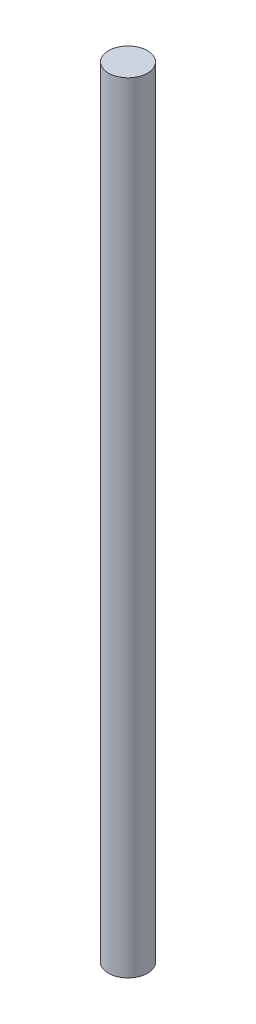
ISO-10303-21;
HEADER;
FILE_DESCRIPTION(('STEP AP214'),'2;1');
FILE_NAME('part.step','',(''),(''),'','','');
FILE_SCHEMA(('AUTOMOTIVE_DESIGN { 1 0 10303 214 1 1 1 1 }'));
ENDSEC;
DATA;
#1=APPLICATION_CONTEXT('core data for automotive mechanical design processes');
#2=APPLICATION_PROTOCOL_DEFINITION('international standard','automotive_design',2000,#1);
#3=PRODUCT_CONTEXT('',#1,'mechanical');
#4=PRODUCT('Part','Part','',(#3));
#5=PRODUCT_RELATED_PRODUCT_CATEGORY('part','',(#4));
#6=PRODUCT_DEFINITION_FORMATION('','',#4);
#7=PRODUCT_DEFINITION_CONTEXT('part definition',#1,'design');
#8=PRODUCT_DEFINITION('design','',#6,#7);
#9=PRODUCT_DEFINITION_SHAPE('','',#8);
#10=(LENGTH_UNIT() NAMED_UNIT(*) SI_UNIT(.MILLI.,.METRE.));
#11=(NAMED_UNIT(*) PLANE_ANGLE_UNIT() SI_UNIT($,.RADIAN.));
#12=(NAMED_UNIT(*) SI_UNIT($,.STERADIAN.) SOLID_ANGLE_UNIT());
#13=UNCERTAINTY_MEASURE_WITH_UNIT(LENGTH_MEASURE(1.E-05),#10,'distance_accuracy_value','');
#14=(GEOMETRIC_REPRESENTATION_CONTEXT(3) GLOBAL_UNCERTAINTY_ASSIGNED_CONTEXT((#13)) GLOBAL_UNIT_ASSIGNED_CONTEXT((#10,
#11,#12)) REPRESENTATION_CONTEXT('',''));
#15=CARTESIAN_POINT('',(0.,0.,0.));
#16=DIRECTION('',(0.,0.,1.));
#17=DIRECTION('',(1.,0.,0.));
#18=AXIS2_PLACEMENT_3D('',#15,#16,#17);
#19=CARTESIAN_POINT('',(0.,0.75,0.));
#20=DIRECTION('',(0.,-1.,0.));
#21=DIRECTION('',(0.,0.,-1.));
#22=AXIS2_PLACEMENT_3D('',#19,#20,#21);
#23=CYLINDRICAL_SURFACE('',#22,0.25);
#24=CARTESIAN_POINT('',(0.,5.,0.));
#25=DIRECTION('',(0.,1.,0.));
#26=DIRECTION('',(0.,0.,1.));
#27=AXIS2_PLACEMENT_3D('',#24,#25,#26);
#28=CIRCLE('',#27,0.25);
#29=CARTESIAN_POINT('',(0.,5.,0.25));
#30=VERTEX_POINT('',#29);
#31=EDGE_CURVE('E10',#30,#30,#28,.T.);
#32=ORIENTED_EDGE('',*,*,#31,.F.);
#33=EDGE_LOOP('',(#32));
#34=FACE_BOUND('',#33,.T.);
#35=CARTESIAN_POINT('',(0.,-5.,0.));
#36=DIRECTION('',(0.,-1.,0.));
#37=DIRECTION('',(0.,0.,-1.));
#38=AXIS2_PLACEMENT_3D('',#35,#36,#37);
#39=CIRCLE('',#38,0.25);
#40=CARTESIAN_POINT('',(0.,-5.,-0.25));
#41=VERTEX_POINT('',#40);
#42=EDGE_CURVE('E41',#41,#41,#39,.T.);
#43=ORIENTED_EDGE('',*,*,#42,.F.);
#44=EDGE_LOOP('',(#43));
#45=FACE_BOUND('',#44,.T.);
#46=ADVANCED_FACE('F35',(#34,#45),#23,.T.);
#47=CARTESIAN_POINT('',(0.,5.,0.));
#48=DIRECTION('',(0.,1.,0.));
#49=DIRECTION('',(0.,0.,1.));
#50=AXIS2_PLACEMENT_3D('',#47,#48,#49);
#51=PLANE('',#50);
#52=ORIENTED_EDGE('',*,*,#31,.T.);
#53=EDGE_LOOP('',(#52));
#54=FACE_BOUND('',#53,.T.);
#55=ADVANCED_FACE('F50',(#54),#51,.T.);
#56=CARTESIAN_POINT('',(0.,-5.,0.));
#57=DIRECTION('',(0.,-1.,0.));
#58=DIRECTION('',(0.,0.,-1.));
#59=AXIS2_PLACEMENT_3D('',#56,#57,#58);
#60=PLANE('',#59);
#61=ORIENTED_EDGE('',*,*,#42,.T.);
#62=EDGE_LOOP('',(#61));
#63=FACE_BOUND('',#62,.T.);
#64=ADVANCED_FACE('F47',(#63),#60,.T.);
#65=CLOSED_SHELL('',(#46,#55,#64));
#66=MANIFOLD_SOLID_BREP('B2',#65);
#67=ADVANCED_BREP_SHAPE_REPRESENTATION('',(#18,#66),#14);
#68=SHAPE_DEFINITION_REPRESENTATION(#9,#67);
ENDSEC;
END-ISO-10303-21;
